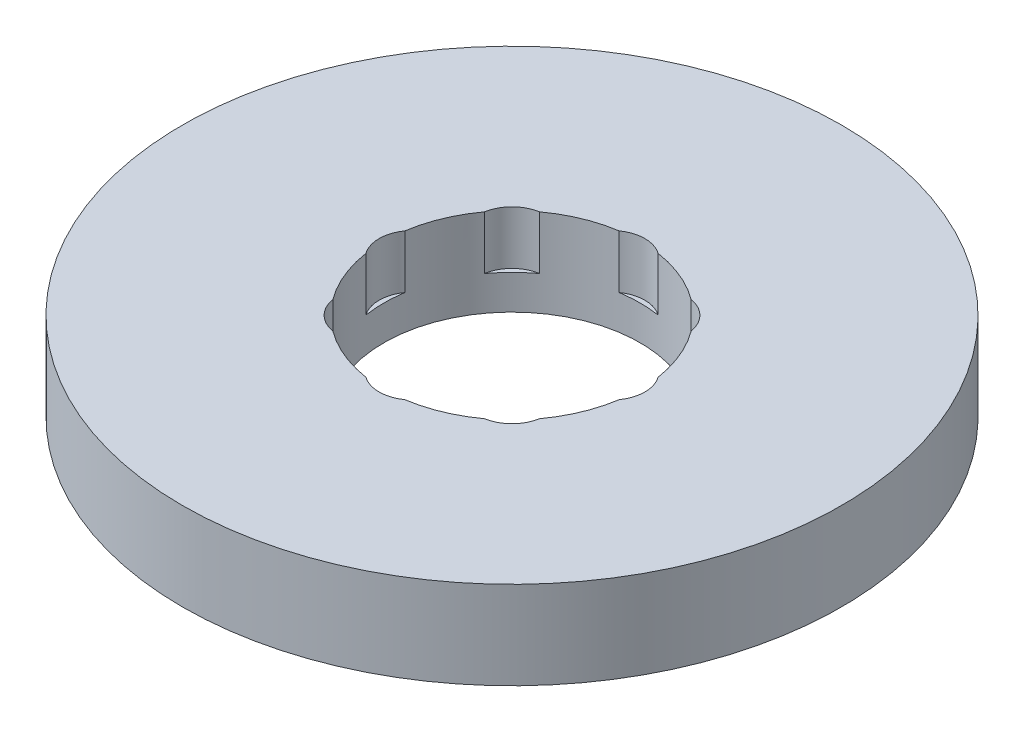
ISO-10303-21;
HEADER;
FILE_DESCRIPTION(('STEP AP214'),'2;1');
FILE_NAME('part.step','',(''),(''),'','','');
FILE_SCHEMA(('AUTOMOTIVE_DESIGN { 1 0 10303 214 1 1 1 1 }'));
ENDSEC;
DATA;
#1=APPLICATION_CONTEXT('core data for automotive mechanical design processes');
#2=APPLICATION_PROTOCOL_DEFINITION('international standard','automotive_design',2000,#1);
#3=PRODUCT_CONTEXT('',#1,'mechanical');
#4=PRODUCT('Part','Part','',(#3));
#5=PRODUCT_RELATED_PRODUCT_CATEGORY('part','',(#4));
#6=PRODUCT_DEFINITION_FORMATION('','',#4);
#7=PRODUCT_DEFINITION_CONTEXT('part definition',#1,'design');
#8=PRODUCT_DEFINITION('design','',#6,#7);
#9=PRODUCT_DEFINITION_SHAPE('','',#8);
#10=(LENGTH_UNIT() NAMED_UNIT(*) SI_UNIT(.MILLI.,.METRE.));
#11=(NAMED_UNIT(*) PLANE_ANGLE_UNIT() SI_UNIT($,.RADIAN.));
#12=(NAMED_UNIT(*) SI_UNIT($,.STERADIAN.) SOLID_ANGLE_UNIT());
#13=UNCERTAINTY_MEASURE_WITH_UNIT(LENGTH_MEASURE(1.E-05),#10,'distance_accuracy_value','');
#14=(GEOMETRIC_REPRESENTATION_CONTEXT(3) GLOBAL_UNCERTAINTY_ASSIGNED_CONTEXT((#13)) GLOBAL_UNIT_ASSIGNED_CONTEXT((#10,
#11,#12)) REPRESENTATION_CONTEXT('',''));
#15=CARTESIAN_POINT('',(0.,0.,0.));
#16=DIRECTION('',(0.,0.,1.));
#17=DIRECTION('',(1.,0.,0.));
#18=AXIS2_PLACEMENT_3D('',#15,#16,#17);
#19=CARTESIAN_POINT('',(0.,12.,0.));
#20=DIRECTION('',(0.,-1.,0.));
#21=DIRECTION('',(0.,0.,-1.));
#22=AXIS2_PLACEMENT_3D('',#19,#20,#21);
#23=CYLINDRICAL_SURFACE('',#22,45.);
#24=CARTESIAN_POINT('',(0.,12.,0.));
#25=DIRECTION('',(0.,1.,0.));
#26=DIRECTION('',(0.,0.,1.));
#27=AXIS2_PLACEMENT_3D('',#24,#25,#26);
#28=CIRCLE('',#27,45.);
#29=CARTESIAN_POINT('',(0.,12.,45.));
#30=VERTEX_POINT('',#29);
#31=EDGE_CURVE('E183',#30,#30,#28,.T.);
#32=ORIENTED_EDGE('',*,*,#31,.F.);
#33=EDGE_LOOP('',(#32));
#34=FACE_BOUND('',#33,.T.);
#35=CARTESIAN_POINT('',(0.,0.,0.));
#36=DIRECTION('',(0.,1.,0.));
#37=DIRECTION('',(0.,0.,1.));
#38=AXIS2_PLACEMENT_3D('',#35,#36,#37);
#39=CIRCLE('',#38,45.);
#40=CARTESIAN_POINT('',(0.,0.,45.));
#41=VERTEX_POINT('',#40);
#42=EDGE_CURVE('E182',#41,#41,#39,.T.);
#43=ORIENTED_EDGE('',*,*,#42,.T.);
#44=EDGE_LOOP('',(#43));
#45=FACE_BOUND('',#44,.T.);
#46=ADVANCED_FACE('F39',(#34,#45),#23,.T.);
#47=CARTESIAN_POINT('',(0.,12.,0.));
#48=DIRECTION('',(0.,1.,0.));
#49=DIRECTION('',(0.,0.,1.));
#50=AXIS2_PLACEMENT_3D('',#47,#48,#49);
#51=PLANE('',#50);
#52=CARTESIAN_POINT('',(0.,12.,13.5593547163367));
#53=DIRECTION('',(0.,1.,0.));
#54=DIRECTION('',(1.,0.,0.));
#55=AXIS2_PLACEMENT_3D('',#52,#53,#54);
#56=CIRCLE('',#55,4.58476057721809);
#57=CARTESIAN_POINT('',(-2.65447655962143,12.,17.2975071670579));
#58=VERTEX_POINT('',#57);
#59=CARTESIAN_POINT('',(2.65447655962155,12.,17.2975071670579));
#60=VERTEX_POINT('',#59);
#61=EDGE_CURVE('E256',#58,#60,#56,.T.);
#62=ORIENTED_EDGE('',*,*,#61,.F.);
#63=CARTESIAN_POINT('',(0.,12.,0.));
#64=DIRECTION('',(0.,1.,0.));
#65=DIRECTION('',(0.,0.,1.));
#66=AXIS2_PLACEMENT_3D('',#63,#64,#65);
#67=CIRCLE('',#66,17.5);
#68=CARTESIAN_POINT('',(-10.3541862396404,12.,14.1081829912587));
#69=VERTEX_POINT('',#68);
#70=EDGE_CURVE('E175',#69,#58,#67,.T.);
#71=ORIENTED_EDGE('',*,*,#70,.F.);
#72=CARTESIAN_POINT('',(-9.58791166843545,12.,9.58791166843548));
#73=DIRECTION('',(0.,1.,0.));
#74=DIRECTION('',(0.707106781186549,0.,0.707106781186546));
#75=AXIS2_PLACEMENT_3D('',#72,#73,#74);
#76=CIRCLE('',#75,4.58476057721809);
#77=CARTESIAN_POINT('',(-14.1081829912586,12.,10.3541862396405));
#78=VERTEX_POINT('',#77);
#79=EDGE_CURVE('E152',#78,#69,#76,.T.);
#80=ORIENTED_EDGE('',*,*,#79,.F.);
#81=CARTESIAN_POINT('',(-17.2975071670579,12.,2.65447655962149));
#82=VERTEX_POINT('',#81);
#83=EDGE_CURVE('E168',#82,#78,#67,.T.);
#84=ORIENTED_EDGE('',*,*,#83,.F.);
#85=CARTESIAN_POINT('',(-13.5593547163367,12.,0.));
#86=DIRECTION('',(0.,1.,0.));
#87=DIRECTION('',(0.,0.,1.));
#88=AXIS2_PLACEMENT_3D('',#85,#86,#87);
#89=CIRCLE('',#88,4.58476057721809);
#90=CARTESIAN_POINT('',(-17.2975071670579,12.,-2.65447655962149));
#91=VERTEX_POINT('',#90);
#92=EDGE_CURVE('E205',#91,#82,#89,.T.);
#93=ORIENTED_EDGE('',*,*,#92,.F.);
#94=CARTESIAN_POINT('',(-14.1081829912588,12.,-10.3541862396403));
#95=VERTEX_POINT('',#94);
#96=EDGE_CURVE('E181',#95,#91,#67,.T.);
#97=ORIENTED_EDGE('',*,*,#96,.F.);
#98=CARTESIAN_POINT('',(-9.58791166843558,12.,-9.58791166843535));
#99=DIRECTION('',(0.,1.,0.));
#100=DIRECTION('',(-0.707106781186539,0.,0.707106781186556));
#101=AXIS2_PLACEMENT_3D('',#98,#99,#100);
#102=CIRCLE('',#101,4.58476057721809);
#103=CARTESIAN_POINT('',(-10.3541862396406,12.,-14.1081829912585));
#104=VERTEX_POINT('',#103);
#105=EDGE_CURVE('E453',#104,#95,#102,.T.);
#106=ORIENTED_EDGE('',*,*,#105,.F.);
#107=CARTESIAN_POINT('',(-2.65447655962167,12.,-17.2975071670579));
#108=VERTEX_POINT('',#107);
#109=EDGE_CURVE('E189',#108,#104,#67,.T.);
#110=ORIENTED_EDGE('',*,*,#109,.F.);
#111=CARTESIAN_POINT('',(-1.42026701876532E-13,12.,-13.5593547163367));
#112=DIRECTION('',(0.,1.,0.));
#113=DIRECTION('',(-1.,0.,0.));
#114=AXIS2_PLACEMENT_3D('',#111,#112,#113);
#115=CIRCLE('',#114,4.58476057721809);
#116=CARTESIAN_POINT('',(2.65447655962131,12.,-17.297507167058));
#117=VERTEX_POINT('',#116);
#118=EDGE_CURVE('E462',#117,#108,#115,.T.);
#119=ORIENTED_EDGE('',*,*,#118,.F.);
#120=CARTESIAN_POINT('',(10.3541862396404,12.,-14.1081829912587));
#121=VERTEX_POINT('',#120);
#122=EDGE_CURVE('E197',#121,#117,#67,.T.);
#123=ORIENTED_EDGE('',*,*,#122,.F.);
#124=CARTESIAN_POINT('',(9.58791166843538,12.,-9.58791166843555));
#125=DIRECTION('',(0.,1.,0.));
#126=DIRECTION('',(-0.707106781186554,0.,-0.707106781186541));
#127=AXIS2_PLACEMENT_3D('',#124,#125,#126);
#128=CIRCLE('',#127,4.58476057721809);
#129=CARTESIAN_POINT('',(14.1081829912586,12.,-10.3541862396406));
#130=VERTEX_POINT('',#129);
#131=EDGE_CURVE('E470',#130,#121,#128,.T.);
#132=ORIENTED_EDGE('',*,*,#131,.F.);
#133=CARTESIAN_POINT('',(17.2975071670579,12.,-2.65447655962149));
#134=VERTEX_POINT('',#133);
#135=EDGE_CURVE('E489',#134,#130,#67,.T.);
#136=ORIENTED_EDGE('',*,*,#135,.F.);
#137=CARTESIAN_POINT('',(13.5593547163367,12.,0.));
#138=DIRECTION('',(0.,1.,0.));
#139=DIRECTION('',(0.,0.,-1.));
#140=AXIS2_PLACEMENT_3D('',#137,#138,#139);
#141=CIRCLE('',#140,4.58476057721809);
#142=CARTESIAN_POINT('',(17.2975071670579,12.,2.65447655962149));
#143=VERTEX_POINT('',#142);
#144=EDGE_CURVE('E476',#143,#134,#141,.T.);
#145=ORIENTED_EDGE('',*,*,#144,.F.);
#146=CARTESIAN_POINT('',(14.1081829912587,12.,10.3541862396404));
#147=VERTEX_POINT('',#146);
#148=EDGE_CURVE('E491',#147,#143,#67,.T.);
#149=ORIENTED_EDGE('',*,*,#148,.F.);
#150=CARTESIAN_POINT('',(9.58791166843552,12.,9.58791166843542));
#151=DIRECTION('',(0.,1.,0.));
#152=DIRECTION('',(0.707106781186544,0.,-0.707106781186551));
#153=AXIS2_PLACEMENT_3D('',#150,#151,#152);
#154=CIRCLE('',#153,4.58476057721809);
#155=CARTESIAN_POINT('',(10.3541862396405,12.,14.1081829912586));
#156=VERTEX_POINT('',#155);
#157=EDGE_CURVE('E475',#156,#147,#154,.T.);
#158=ORIENTED_EDGE('',*,*,#157,.F.);
#159=EDGE_CURVE('E190',#60,#156,#67,.T.);
#160=ORIENTED_EDGE('',*,*,#159,.F.);
#161=EDGE_LOOP('',(#62,#71,#80,#84,#93,#97,#106,#110,#119,#123,#132,#136,#145,#149,#158,#160));
#162=FACE_BOUND('',#161,.T.);
#163=ORIENTED_EDGE('',*,*,#31,.T.);
#164=EDGE_LOOP('',(#163));
#165=FACE_BOUND('',#164,.T.);
#166=ADVANCED_FACE('F170',(#162,#165),#51,.T.);
#167=CARTESIAN_POINT('',(0.,0.,0.));
#168=DIRECTION('',(0.,1.,0.));
#169=DIRECTION('',(0.,0.,1.));
#170=AXIS2_PLACEMENT_3D('',#167,#168,#169);
#171=PLANE('',#170);
#172=CARTESIAN_POINT('',(0.,0.,0.));
#173=DIRECTION('',(0.,1.,0.));
#174=DIRECTION('',(0.,0.,1.));
#175=AXIS2_PLACEMENT_3D('',#172,#173,#174);
#176=CIRCLE('',#175,17.5);
#177=CARTESIAN_POINT('',(0.,0.,17.5));
#178=VERTEX_POINT('',#177);
#179=EDGE_CURVE('E191',#178,#178,#176,.T.);
#180=ORIENTED_EDGE('',*,*,#179,.T.);
#181=EDGE_LOOP('',(#180));
#182=FACE_BOUND('',#181,.T.);
#183=ORIENTED_EDGE('',*,*,#42,.F.);
#184=EDGE_LOOP('',(#183));
#185=FACE_BOUND('',#184,.T.);
#186=ADVANCED_FACE('F277',(#182,#185),#171,.F.);
#187=CARTESIAN_POINT('',(0.,12.,0.));
#188=DIRECTION('',(0.,-1.,0.));
#189=DIRECTION('',(0.,0.,-1.));
#190=AXIS2_PLACEMENT_3D('',#187,#188,#189);
#191=CYLINDRICAL_SURFACE('',#190,17.5);
#192=DIRECTION('',(0.,1.,0.));
#193=VECTOR('',#192,1.);
#194=CARTESIAN_POINT('',(-2.65447655962143,8.35438478433052,17.2975071670579));
#195=LINE('',#194,#193);
#196=CARTESIAN_POINT('',(-2.65447655962143,4.70876956866104,17.2975071670579));
#197=VERTEX_POINT('',#196);
#198=EDGE_CURVE('E11',#197,#58,#195,.T.);
#199=ORIENTED_EDGE('',*,*,#198,.F.);
#200=CARTESIAN_POINT('',(0.,4.70876956866104,0.));
#201=DIRECTION('',(0.,1.,0.));
#202=DIRECTION('',(0.,0.,1.));
#203=AXIS2_PLACEMENT_3D('',#200,#201,#202);
#204=CIRCLE('',#203,17.5);
#205=CARTESIAN_POINT('',(2.65447655962155,4.70876956866104,17.2975071670579));
#206=VERTEX_POINT('',#205);
#207=EDGE_CURVE('E251',#197,#206,#204,.T.);
#208=ORIENTED_EDGE('',*,*,#207,.T.);
#209=DIRECTION('',(0.,1.,0.));
#210=VECTOR('',#209,1.);
#211=CARTESIAN_POINT('',(2.65447655962155,8.35438478433052,17.2975071670579));
#212=LINE('',#211,#210);
#213=EDGE_CURVE('E46',#60,#206,#212,.F.);
#214=ORIENTED_EDGE('',*,*,#213,.F.);
#215=ORIENTED_EDGE('',*,*,#159,.T.);
#216=DIRECTION('',(0.,1.,0.));
#217=VECTOR('',#216,1.);
#218=CARTESIAN_POINT('',(10.3541862396406,8.35438478433052,14.1081829912586));
#219=LINE('',#218,#217);
#220=CARTESIAN_POINT('',(10.3541862396405,4.70876956866104,14.1081829912586));
#221=VERTEX_POINT('',#220);
#222=EDGE_CURVE('E253',#221,#156,#219,.T.);
#223=ORIENTED_EDGE('',*,*,#222,.F.);
#224=CARTESIAN_POINT('',(0.,4.70876956866104,0.));
#225=DIRECTION('',(0.,1.,0.));
#226=DIRECTION('',(0.,0.,1.));
#227=AXIS2_PLACEMENT_3D('',#224,#225,#226);
#228=CIRCLE('',#227,17.5);
#229=CARTESIAN_POINT('',(14.1081829912587,4.70876956866104,10.3541862396404));
#230=VERTEX_POINT('',#229);
#231=EDGE_CURVE('E246',#221,#230,#228,.T.);
#232=ORIENTED_EDGE('',*,*,#231,.T.);
#233=DIRECTION('',(0.,1.,0.));
#234=VECTOR('',#233,1.);
#235=CARTESIAN_POINT('',(14.1081829912587,8.35438478433052,10.3541862396404));
#236=LINE('',#235,#234);
#237=EDGE_CURVE('E248',#147,#230,#236,.F.);
#238=ORIENTED_EDGE('',*,*,#237,.F.);
#239=ORIENTED_EDGE('',*,*,#148,.T.);
#240=DIRECTION('',(0.,1.,0.));
#241=VECTOR('',#240,1.);
#242=CARTESIAN_POINT('',(17.2975071670579,8.35438478433052,2.65447655962149));
#243=LINE('',#242,#241);
#244=CARTESIAN_POINT('',(17.2975071670579,4.70876956866104,2.65447655962149));
#245=VERTEX_POINT('',#244);
#246=EDGE_CURVE('E243',#245,#143,#243,.T.);
#247=ORIENTED_EDGE('',*,*,#246,.F.);
#248=CARTESIAN_POINT('',(0.,4.70876956866104,0.));
#249=DIRECTION('',(0.,1.,0.));
#250=DIRECTION('',(0.,0.,1.));
#251=AXIS2_PLACEMENT_3D('',#248,#249,#250);
#252=CIRCLE('',#251,17.5);
#253=CARTESIAN_POINT('',(17.2975071670579,4.70876956866104,-2.65447655962149));
#254=VERTEX_POINT('',#253);
#255=EDGE_CURVE('E236',#245,#254,#252,.T.);
#256=ORIENTED_EDGE('',*,*,#255,.T.);
#257=DIRECTION('',(0.,1.,0.));
#258=VECTOR('',#257,1.);
#259=CARTESIAN_POINT('',(17.2975071670579,8.35438478433052,-2.65447655962149));
#260=LINE('',#259,#258);
#261=EDGE_CURVE('E241',#134,#254,#260,.F.);
#262=ORIENTED_EDGE('',*,*,#261,.F.);
#263=ORIENTED_EDGE('',*,*,#135,.T.);
#264=DIRECTION('',(0.,1.,0.));
#265=VECTOR('',#264,1.);
#266=CARTESIAN_POINT('',(14.1081829912586,8.35438478433052,-10.3541862396406));
#267=LINE('',#266,#265);
#268=CARTESIAN_POINT('',(14.1081829912586,4.70876956866104,-10.3541862396406));
#269=VERTEX_POINT('',#268);
#270=EDGE_CURVE('E237',#269,#130,#267,.T.);
#271=ORIENTED_EDGE('',*,*,#270,.F.);
#272=CARTESIAN_POINT('',(0.,4.70876956866104,0.));
#273=DIRECTION('',(0.,1.,0.));
#274=DIRECTION('',(0.,0.,1.));
#275=AXIS2_PLACEMENT_3D('',#272,#273,#274);
#276=CIRCLE('',#275,17.5);
#277=CARTESIAN_POINT('',(10.3541862396404,4.70876956866104,-14.1081829912587));
#278=VERTEX_POINT('',#277);
#279=EDGE_CURVE('E229',#269,#278,#276,.T.);
#280=ORIENTED_EDGE('',*,*,#279,.T.);
#281=DIRECTION('',(0.,1.,0.));
#282=VECTOR('',#281,1.);
#283=CARTESIAN_POINT('',(10.3541862396404,8.35438478433052,-14.1081829912587));
#284=LINE('',#283,#282);
#285=EDGE_CURVE('E232',#121,#278,#284,.F.);
#286=ORIENTED_EDGE('',*,*,#285,.F.);
#287=ORIENTED_EDGE('',*,*,#122,.T.);
#288=DIRECTION('',(0.,1.,0.));
#289=VECTOR('',#288,1.);
#290=CARTESIAN_POINT('',(2.6544765596213,8.35438478433052,-17.297507167058));
#291=LINE('',#290,#289);
#292=CARTESIAN_POINT('',(2.65447655962131,4.70876956866104,-17.297507167058));
#293=VERTEX_POINT('',#292);
#294=EDGE_CURVE('E227',#293,#117,#291,.T.);
#295=ORIENTED_EDGE('',*,*,#294,.F.);
#296=CARTESIAN_POINT('',(0.,4.70876956866104,0.));
#297=DIRECTION('',(0.,1.,0.));
#298=DIRECTION('',(0.,0.,1.));
#299=AXIS2_PLACEMENT_3D('',#296,#297,#298);
#300=CIRCLE('',#299,17.5);
#301=CARTESIAN_POINT('',(-2.65447655962167,4.70876956866104,-17.2975071670579));
#302=VERTEX_POINT('',#301);
#303=EDGE_CURVE('E225',#293,#302,#300,.T.);
#304=ORIENTED_EDGE('',*,*,#303,.T.);
#305=DIRECTION('',(0.,1.,0.));
#306=VECTOR('',#305,1.);
#307=CARTESIAN_POINT('',(-2.65447655962167,8.35438478433052,-17.2975071670579));
#308=LINE('',#307,#306);
#309=EDGE_CURVE('E223',#108,#302,#308,.F.);
#310=ORIENTED_EDGE('',*,*,#309,.F.);
#311=ORIENTED_EDGE('',*,*,#109,.T.);
#312=DIRECTION('',(0.,1.,0.));
#313=VECTOR('',#312,1.);
#314=CARTESIAN_POINT('',(-10.3541862396406,8.35438478433052,-14.1081829912585));
#315=LINE('',#314,#313);
#316=CARTESIAN_POINT('',(-10.3541862396406,4.70876956866104,-14.1081829912585));
#317=VERTEX_POINT('',#316);
#318=EDGE_CURVE('E219',#317,#104,#315,.T.);
#319=ORIENTED_EDGE('',*,*,#318,.F.);
#320=CARTESIAN_POINT('',(0.,4.70876956866104,0.));
#321=DIRECTION('',(0.,1.,0.));
#322=DIRECTION('',(0.,0.,1.));
#323=AXIS2_PLACEMENT_3D('',#320,#321,#322);
#324=CIRCLE('',#323,17.5);
#325=CARTESIAN_POINT('',(-14.1081829912588,4.70876956866104,-10.3541862396403));
#326=VERTEX_POINT('',#325);
#327=EDGE_CURVE('E159',#317,#326,#324,.T.);
#328=ORIENTED_EDGE('',*,*,#327,.T.);
#329=DIRECTION('',(0.,1.,0.));
#330=VECTOR('',#329,1.);
#331=CARTESIAN_POINT('',(-14.1081829912588,8.35438478433052,-10.3541862396403));
#332=LINE('',#331,#330);
#333=EDGE_CURVE('E220',#95,#326,#332,.F.);
#334=ORIENTED_EDGE('',*,*,#333,.F.);
#335=ORIENTED_EDGE('',*,*,#96,.T.);
#336=DIRECTION('',(0.,1.,0.));
#337=VECTOR('',#336,1.);
#338=CARTESIAN_POINT('',(-17.2975071670579,8.35438478433052,-2.65447655962149));
#339=LINE('',#338,#337);
#340=CARTESIAN_POINT('',(-17.2975071670579,4.70876956866104,-2.65447655962149));
#341=VERTEX_POINT('',#340);
#342=EDGE_CURVE('E209',#341,#91,#339,.T.);
#343=ORIENTED_EDGE('',*,*,#342,.F.);
#344=CARTESIAN_POINT('',(0.,4.70876956866104,0.));
#345=DIRECTION('',(0.,1.,0.));
#346=DIRECTION('',(0.,0.,1.));
#347=AXIS2_PLACEMENT_3D('',#344,#345,#346);
#348=CIRCLE('',#347,17.5);
#349=CARTESIAN_POINT('',(-17.2975071670579,4.70876956866104,2.65447655962149));
#350=VERTEX_POINT('',#349);
#351=EDGE_CURVE('E206',#341,#350,#348,.T.);
#352=ORIENTED_EDGE('',*,*,#351,.T.);
#353=DIRECTION('',(0.,1.,0.));
#354=VECTOR('',#353,1.);
#355=CARTESIAN_POINT('',(-17.2975071670579,8.35438478433052,2.65447655962149));
#356=LINE('',#355,#354);
#357=EDGE_CURVE('E179',#82,#350,#356,.F.);
#358=ORIENTED_EDGE('',*,*,#357,.F.);
#359=ORIENTED_EDGE('',*,*,#83,.T.);
#360=DIRECTION('',(0.,1.,0.));
#361=VECTOR('',#360,1.);
#362=CARTESIAN_POINT('',(-14.1081829912586,8.35438478433052,10.3541862396405));
#363=LINE('',#362,#361);
#364=CARTESIAN_POINT('',(-14.1081829912586,4.70876956866104,10.3541862396405));
#365=VERTEX_POINT('',#364);
#366=EDGE_CURVE('E147',#365,#78,#363,.T.);
#367=ORIENTED_EDGE('',*,*,#366,.F.);
#368=CARTESIAN_POINT('',(0.,4.70876956866104,0.));
#369=DIRECTION('',(0.,1.,0.));
#370=DIRECTION('',(0.,0.,1.));
#371=AXIS2_PLACEMENT_3D('',#368,#369,#370);
#372=CIRCLE('',#371,17.5);
#373=CARTESIAN_POINT('',(-10.3541862396404,4.70876956866104,14.1081829912587));
#374=VERTEX_POINT('',#373);
#375=EDGE_CURVE('E215',#365,#374,#372,.T.);
#376=ORIENTED_EDGE('',*,*,#375,.T.);
#377=DIRECTION('',(0.,1.,0.));
#378=VECTOR('',#377,1.);
#379=CARTESIAN_POINT('',(-10.3541862396405,8.35438478433052,14.1081829912587));
#380=LINE('',#379,#378);
#381=EDGE_CURVE('E161',#69,#374,#380,.F.);
#382=ORIENTED_EDGE('',*,*,#381,.F.);
#383=ORIENTED_EDGE('',*,*,#70,.T.);
#384=EDGE_LOOP('',(#199,#208,#214,#215,#223,#232,#238,#239,#247,#256,#262,#263,#271,#280,#286,
#287,#295,#304,#310,#311,#319,#328,#334,#335,#343,#352,#358,#359,#367,#376,#382,#383));
#385=FACE_BOUND('',#384,.T.);
#386=ORIENTED_EDGE('',*,*,#179,.F.);
#387=EDGE_LOOP('',(#386));
#388=FACE_BOUND('',#387,.T.);
#389=ADVANCED_FACE('F176',(#385,#388),#191,.F.);
#390=CARTESIAN_POINT('',(-13.5593547163367,4.70876956866104,0.));
#391=DIRECTION('',(0.,1.,0.));
#392=DIRECTION('',(0.,0.,1.));
#393=AXIS2_PLACEMENT_3D('',#390,#391,#392);
#394=CYLINDRICAL_SURFACE('',#393,4.58476057721809);
#395=ORIENTED_EDGE('',*,*,#342,.T.);
#396=ORIENTED_EDGE('',*,*,#92,.T.);
#397=ORIENTED_EDGE('',*,*,#357,.T.);
#398=CARTESIAN_POINT('',(-13.5593547163367,4.70876956866104,0.));
#399=DIRECTION('',(0.,1.,0.));
#400=DIRECTION('',(0.,0.,1.));
#401=AXIS2_PLACEMENT_3D('',#398,#399,#400);
#402=CIRCLE('',#401,4.58476057721809);
#403=EDGE_CURVE('E200',#341,#350,#402,.T.);
#404=ORIENTED_EDGE('',*,*,#403,.F.);
#405=EDGE_LOOP('',(#395,#396,#397,#404));
#406=FACE_BOUND('',#405,.T.);
#407=ADVANCED_FACE('F286',(#406),#394,.F.);
#408=CARTESIAN_POINT('',(-13.5593547163367,4.70876956866104,0.));
#409=DIRECTION('',(0.,1.,0.));
#410=DIRECTION('',(0.,0.,1.));
#411=AXIS2_PLACEMENT_3D('',#408,#409,#410);
#412=PLANE('',#411);
#413=ORIENTED_EDGE('',*,*,#403,.T.);
#414=ORIENTED_EDGE('',*,*,#351,.F.);
#415=EDGE_LOOP('',(#413,#414));
#416=FACE_BOUND('',#415,.T.);
#417=ADVANCED_FACE('F289',(#416),#412,.T.);
#418=CARTESIAN_POINT('',(-9.58791166843545,4.70876956866104,9.58791166843548));
#419=DIRECTION('',(0.,1.,0.));
#420=DIRECTION('',(0.,0.,1.));
#421=AXIS2_PLACEMENT_3D('',#418,#419,#420);
#422=CYLINDRICAL_SURFACE('',#421,4.58476057721809);
#423=ORIENTED_EDGE('',*,*,#366,.T.);
#424=ORIENTED_EDGE('',*,*,#79,.T.);
#425=ORIENTED_EDGE('',*,*,#381,.T.);
#426=CARTESIAN_POINT('',(-9.58791166843545,4.70876956866104,9.58791166843548));
#427=DIRECTION('',(0.,1.,0.));
#428=DIRECTION('',(0.707106781186549,0.,0.707106781186546));
#429=AXIS2_PLACEMENT_3D('',#426,#427,#428);
#430=CIRCLE('',#429,4.58476057721809);
#431=EDGE_CURVE('E156',#365,#374,#430,.T.);
#432=ORIENTED_EDGE('',*,*,#431,.F.);
#433=EDGE_LOOP('',(#423,#424,#425,#432));
#434=FACE_BOUND('',#433,.T.);
#435=ADVANCED_FACE('F155',(#434),#422,.F.);
#436=CARTESIAN_POINT('',(-9.58791166843545,4.70876956866104,9.58791166843548));
#437=DIRECTION('',(0.,1.,0.));
#438=DIRECTION('',(0.707106781186549,0.,0.707106781186546));
#439=AXIS2_PLACEMENT_3D('',#436,#437,#438);
#440=PLANE('',#439);
#441=ORIENTED_EDGE('',*,*,#431,.T.);
#442=ORIENTED_EDGE('',*,*,#375,.F.);
#443=EDGE_LOOP('',(#441,#442));
#444=FACE_BOUND('',#443,.T.);
#445=ADVANCED_FACE('F300',(#444),#440,.T.);
#446=CARTESIAN_POINT('',(-9.58791166843558,4.70876956866104,-9.58791166843535));
#447=DIRECTION('',(0.,1.,0.));
#448=DIRECTION('',(0.,0.,1.));
#449=AXIS2_PLACEMENT_3D('',#446,#447,#448);
#450=CYLINDRICAL_SURFACE('',#449,4.58476057721809);
#451=ORIENTED_EDGE('',*,*,#318,.T.);
#452=ORIENTED_EDGE('',*,*,#105,.T.);
#453=ORIENTED_EDGE('',*,*,#333,.T.);
#454=CARTESIAN_POINT('',(-9.58791166843558,4.70876956866104,-9.58791166843535));
#455=DIRECTION('',(0.,1.,0.));
#456=DIRECTION('',(-0.707106781186539,0.,0.707106781186556));
#457=AXIS2_PLACEMENT_3D('',#454,#455,#456);
#458=CIRCLE('',#457,4.58476057721809);
#459=EDGE_CURVE('E454',#317,#326,#458,.T.);
#460=ORIENTED_EDGE('',*,*,#459,.F.);
#461=EDGE_LOOP('',(#451,#452,#453,#460));
#462=FACE_BOUND('',#461,.T.);
#463=ADVANCED_FACE('F299',(#462),#450,.F.);
#464=CARTESIAN_POINT('',(-9.58791166843558,4.70876956866104,-9.58791166843535));
#465=DIRECTION('',(0.,1.,0.));
#466=DIRECTION('',(-0.707106781186539,0.,0.707106781186556));
#467=AXIS2_PLACEMENT_3D('',#464,#465,#466);
#468=PLANE('',#467);
#469=ORIENTED_EDGE('',*,*,#459,.T.);
#470=ORIENTED_EDGE('',*,*,#327,.F.);
#471=EDGE_LOOP('',(#469,#470));
#472=FACE_BOUND('',#471,.T.);
#473=ADVANCED_FACE('F379',(#472),#468,.T.);
#474=CARTESIAN_POINT('',(-1.42026701876532E-13,4.70876956866104,-13.5593547163367));
#475=DIRECTION('',(0.,1.,0.));
#476=DIRECTION('',(0.,0.,1.));
#477=AXIS2_PLACEMENT_3D('',#474,#475,#476);
#478=CYLINDRICAL_SURFACE('',#477,4.58476057721809);
#479=ORIENTED_EDGE('',*,*,#294,.T.);
#480=ORIENTED_EDGE('',*,*,#118,.T.);
#481=ORIENTED_EDGE('',*,*,#309,.T.);
#482=CARTESIAN_POINT('',(-1.42026701876532E-13,4.70876956866104,-13.5593547163367));
#483=DIRECTION('',(0.,1.,0.));
#484=DIRECTION('',(-1.,0.,0.));
#485=AXIS2_PLACEMENT_3D('',#482,#483,#484);
#486=CIRCLE('',#485,4.58476057721809);
#487=EDGE_CURVE('E465',#293,#302,#486,.T.);
#488=ORIENTED_EDGE('',*,*,#487,.F.);
#489=EDGE_LOOP('',(#479,#480,#481,#488));
#490=FACE_BOUND('',#489,.T.);
#491=ADVANCED_FACE('F371',(#490),#478,.F.);
#492=CARTESIAN_POINT('',(-1.42026701876532E-13,4.70876956866104,-13.5593547163367));
#493=DIRECTION('',(0.,1.,0.));
#494=DIRECTION('',(-1.,0.,0.));
#495=AXIS2_PLACEMENT_3D('',#492,#493,#494);
#496=PLANE('',#495);
#497=ORIENTED_EDGE('',*,*,#487,.T.);
#498=ORIENTED_EDGE('',*,*,#303,.F.);
#499=EDGE_LOOP('',(#497,#498));
#500=FACE_BOUND('',#499,.T.);
#501=ADVANCED_FACE('F308',(#500),#496,.T.);
#502=CARTESIAN_POINT('',(9.58791166843538,4.70876956866104,-9.58791166843555));
#503=DIRECTION('',(0.,1.,0.));
#504=DIRECTION('',(0.,0.,1.));
#505=AXIS2_PLACEMENT_3D('',#502,#503,#504);
#506=CYLINDRICAL_SURFACE('',#505,4.58476057721809);
#507=ORIENTED_EDGE('',*,*,#270,.T.);
#508=ORIENTED_EDGE('',*,*,#131,.T.);
#509=ORIENTED_EDGE('',*,*,#285,.T.);
#510=CARTESIAN_POINT('',(9.58791166843538,4.70876956866104,-9.58791166843555));
#511=DIRECTION('',(0.,1.,0.));
#512=DIRECTION('',(-0.707106781186554,0.,-0.707106781186541));
#513=AXIS2_PLACEMENT_3D('',#510,#511,#512);
#514=CIRCLE('',#513,4.58476057721809);
#515=EDGE_CURVE('E477',#269,#278,#514,.T.);
#516=ORIENTED_EDGE('',*,*,#515,.F.);
#517=EDGE_LOOP('',(#507,#508,#509,#516));
#518=FACE_BOUND('',#517,.T.);
#519=ADVANCED_FACE('F305',(#518),#506,.F.);
#520=CARTESIAN_POINT('',(9.58791166843538,4.70876956866104,-9.58791166843555));
#521=DIRECTION('',(0.,1.,0.));
#522=DIRECTION('',(-0.707106781186554,0.,-0.707106781186541));
#523=AXIS2_PLACEMENT_3D('',#520,#521,#522);
#524=PLANE('',#523);
#525=ORIENTED_EDGE('',*,*,#515,.T.);
#526=ORIENTED_EDGE('',*,*,#279,.F.);
#527=EDGE_LOOP('',(#525,#526));
#528=FACE_BOUND('',#527,.T.);
#529=ADVANCED_FACE('F304',(#528),#524,.T.);
#530=CARTESIAN_POINT('',(13.5593547163367,4.70876956866104,0.));
#531=DIRECTION('',(0.,1.,0.));
#532=DIRECTION('',(0.,0.,1.));
#533=AXIS2_PLACEMENT_3D('',#530,#531,#532);
#534=CYLINDRICAL_SURFACE('',#533,4.58476057721809);
#535=ORIENTED_EDGE('',*,*,#246,.T.);
#536=ORIENTED_EDGE('',*,*,#144,.T.);
#537=ORIENTED_EDGE('',*,*,#261,.T.);
#538=CARTESIAN_POINT('',(13.5593547163367,4.70876956866104,0.));
#539=DIRECTION('',(0.,1.,0.));
#540=DIRECTION('',(0.,0.,-1.));
#541=AXIS2_PLACEMENT_3D('',#538,#539,#540);
#542=CIRCLE('',#541,4.58476057721809);
#543=EDGE_CURVE('E478',#245,#254,#542,.T.);
#544=ORIENTED_EDGE('',*,*,#543,.F.);
#545=EDGE_LOOP('',(#535,#536,#537,#544));
#546=FACE_BOUND('',#545,.T.);
#547=ADVANCED_FACE('F309',(#546),#534,.F.);
#548=CARTESIAN_POINT('',(13.5593547163367,4.70876956866104,0.));
#549=DIRECTION('',(0.,1.,0.));
#550=DIRECTION('',(0.,0.,-1.));
#551=AXIS2_PLACEMENT_3D('',#548,#549,#550);
#552=PLANE('',#551);
#553=ORIENTED_EDGE('',*,*,#543,.T.);
#554=ORIENTED_EDGE('',*,*,#255,.F.);
#555=EDGE_LOOP('',(#553,#554));
#556=FACE_BOUND('',#555,.T.);
#557=ADVANCED_FACE('F314',(#556),#552,.T.);
#558=CARTESIAN_POINT('',(9.58791166843552,4.70876956866104,9.58791166843542));
#559=DIRECTION('',(0.,1.,0.));
#560=DIRECTION('',(0.,0.,1.));
#561=AXIS2_PLACEMENT_3D('',#558,#559,#560);
#562=CYLINDRICAL_SURFACE('',#561,4.58476057721809);
#563=ORIENTED_EDGE('',*,*,#222,.T.);
#564=ORIENTED_EDGE('',*,*,#157,.T.);
#565=ORIENTED_EDGE('',*,*,#237,.T.);
#566=CARTESIAN_POINT('',(9.58791166843552,4.70876956866104,9.58791166843542));
#567=DIRECTION('',(0.,1.,0.));
#568=DIRECTION('',(0.707106781186544,0.,-0.707106781186551));
#569=AXIS2_PLACEMENT_3D('',#566,#567,#568);
#570=CIRCLE('',#569,4.58476057721809);
#571=EDGE_CURVE('E56',#221,#230,#570,.T.);
#572=ORIENTED_EDGE('',*,*,#571,.F.);
#573=EDGE_LOOP('',(#563,#564,#565,#572));
#574=FACE_BOUND('',#573,.T.);
#575=ADVANCED_FACE('F318',(#574),#562,.F.);
#576=CARTESIAN_POINT('',(9.58791166843552,4.70876956866104,9.58791166843542));
#577=DIRECTION('',(0.,1.,0.));
#578=DIRECTION('',(0.707106781186544,0.,-0.707106781186551));
#579=AXIS2_PLACEMENT_3D('',#576,#577,#578);
#580=PLANE('',#579);
#581=ORIENTED_EDGE('',*,*,#571,.T.);
#582=ORIENTED_EDGE('',*,*,#231,.F.);
#583=EDGE_LOOP('',(#581,#582));
#584=FACE_BOUND('',#583,.T.);
#585=ADVANCED_FACE('F270',(#584),#580,.T.);
#586=CARTESIAN_POINT('',(0.,4.70876956866104,13.5593547163367));
#587=DIRECTION('',(0.,1.,0.));
#588=DIRECTION('',(0.,0.,1.));
#589=AXIS2_PLACEMENT_3D('',#586,#587,#588);
#590=CYLINDRICAL_SURFACE('',#589,4.58476057721809);
#591=ORIENTED_EDGE('',*,*,#198,.T.);
#592=ORIENTED_EDGE('',*,*,#61,.T.);
#593=ORIENTED_EDGE('',*,*,#213,.T.);
#594=CARTESIAN_POINT('',(0.,4.70876956866104,13.5593547163367));
#595=DIRECTION('',(0.,1.,0.));
#596=DIRECTION('',(1.,0.,0.));
#597=AXIS2_PLACEMENT_3D('',#594,#595,#596);
#598=CIRCLE('',#597,4.58476057721809);
#599=EDGE_CURVE('E55',#197,#206,#598,.T.);
#600=ORIENTED_EDGE('',*,*,#599,.F.);
#601=EDGE_LOOP('',(#591,#592,#593,#600));
#602=FACE_BOUND('',#601,.T.);
#603=ADVANCED_FACE('F260',(#602),#590,.F.);
#604=CARTESIAN_POINT('',(0.,4.70876956866104,13.5593547163367));
#605=DIRECTION('',(0.,1.,0.));
#606=DIRECTION('',(1.,0.,0.));
#607=AXIS2_PLACEMENT_3D('',#604,#605,#606);
#608=PLANE('',#607);
#609=ORIENTED_EDGE('',*,*,#599,.T.);
#610=ORIENTED_EDGE('',*,*,#207,.F.);
#611=EDGE_LOOP('',(#609,#610));
#612=FACE_BOUND('',#611,.T.);
#613=ADVANCED_FACE('F261',(#612),#608,.T.);
#614=CLOSED_SHELL('',(#46,#166,#186,#389,#407,#417,#435,#445,#463,#473,#491,#501,#519,#529,#547,
#557,#575,#585,#603,#613));
#615=MANIFOLD_SOLID_BREP('B2',#614);
#616=ADVANCED_BREP_SHAPE_REPRESENTATION('',(#18,#615),#14);
#617=SHAPE_DEFINITION_REPRESENTATION(#9,#616);
ENDSEC;
END-ISO-10303-21;
